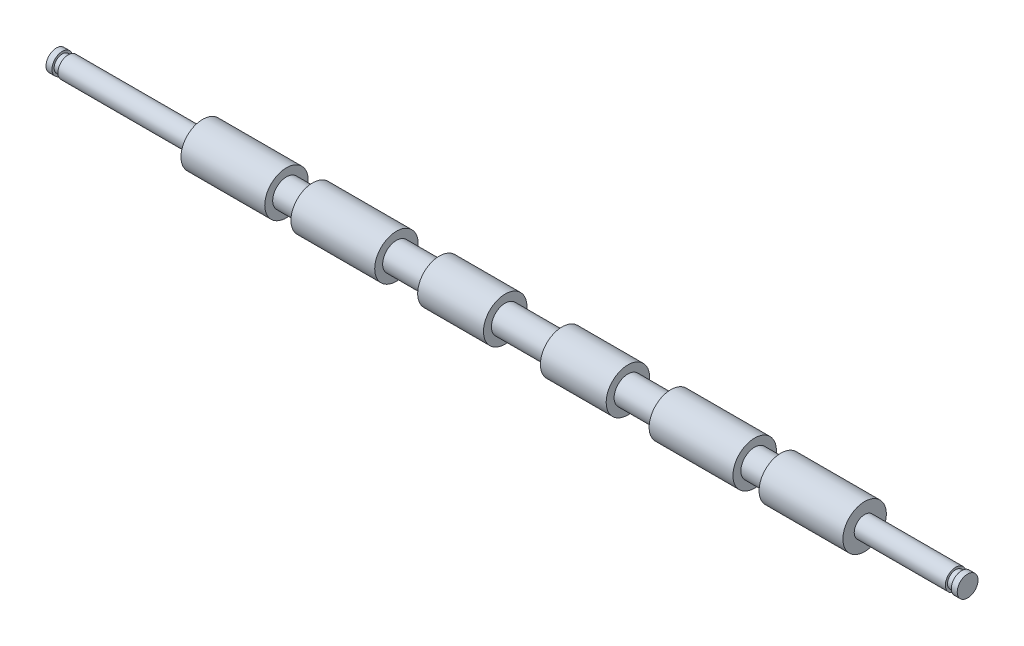
ISO-10303-21;
HEADER;
FILE_DESCRIPTION(('STEP AP214'),'2;1');
FILE_NAME('part.step','',(''),(''),'','','');
FILE_SCHEMA(('AUTOMOTIVE_DESIGN { 1 0 10303 214 1 1 1 1 }'));
ENDSEC;
DATA;
#1=APPLICATION_CONTEXT('core data for automotive mechanical design processes');
#2=APPLICATION_PROTOCOL_DEFINITION('international standard','automotive_design',2000,#1);
#3=PRODUCT_CONTEXT('',#1,'mechanical');
#4=PRODUCT('Part','Part','',(#3));
#5=PRODUCT_RELATED_PRODUCT_CATEGORY('part','',(#4));
#6=PRODUCT_DEFINITION_FORMATION('','',#4);
#7=PRODUCT_DEFINITION_CONTEXT('part definition',#1,'design');
#8=PRODUCT_DEFINITION('design','',#6,#7);
#9=PRODUCT_DEFINITION_SHAPE('','',#8);
#10=(LENGTH_UNIT() NAMED_UNIT(*) SI_UNIT(.MILLI.,.METRE.));
#11=(NAMED_UNIT(*) PLANE_ANGLE_UNIT() SI_UNIT($,.RADIAN.));
#12=(NAMED_UNIT(*) SI_UNIT($,.STERADIAN.) SOLID_ANGLE_UNIT());
#13=UNCERTAINTY_MEASURE_WITH_UNIT(LENGTH_MEASURE(1.E-05),#10,'distance_accuracy_value','');
#14=(GEOMETRIC_REPRESENTATION_CONTEXT(3) GLOBAL_UNCERTAINTY_ASSIGNED_CONTEXT((#13)) GLOBAL_UNIT_ASSIGNED_CONTEXT((#10,
#11,#12)) REPRESENTATION_CONTEXT('',''));
#15=CARTESIAN_POINT('',(0.,0.,0.));
#16=DIRECTION('',(0.,0.,1.));
#17=DIRECTION('',(1.,0.,0.));
#18=AXIS2_PLACEMENT_3D('',#15,#16,#17);
#19=CARTESIAN_POINT('',(0.,0.,0.));
#20=DIRECTION('',(1.,0.,0.));
#21=DIRECTION('',(0.,0.,-1.));
#22=AXIS2_PLACEMENT_3D('',#19,#20,#21);
#23=PLANE('',#22);
#24=CARTESIAN_POINT('',(0.,0.,0.));
#25=DIRECTION('',(-1.,0.,0.));
#26=DIRECTION('',(0.,0.,1.));
#27=AXIS2_PLACEMENT_3D('',#24,#25,#26);
#28=CIRCLE('',#27,2.98);
#29=CARTESIAN_POINT('',(0.,0.,2.98));
#30=VERTEX_POINT('',#29);
#31=EDGE_CURVE('E10',#30,#30,#28,.T.);
#32=ORIENTED_EDGE('',*,*,#31,.T.);
#33=EDGE_LOOP('',(#32));
#34=FACE_BOUND('',#33,.T.);
#35=ADVANCED_FACE('F32',(#34),#23,.F.);
#36=CARTESIAN_POINT('',(0.,0.,0.));
#37=DIRECTION('',(-1.,0.,0.));
#38=DIRECTION('',(0.,0.,1.));
#39=AXIS2_PLACEMENT_3D('',#36,#37,#38);
#40=CYLINDRICAL_SURFACE('',#39,2.98);
#41=ORIENTED_EDGE('',*,*,#31,.F.);
#42=EDGE_LOOP('',(#41));
#43=FACE_BOUND('',#42,.T.);
#44=CARTESIAN_POINT('',(1.7,0.,0.));
#45=DIRECTION('',(-1.,0.,0.));
#46=DIRECTION('',(0.,0.,1.));
#47=AXIS2_PLACEMENT_3D('',#44,#45,#46);
#48=CIRCLE('',#47,2.98);
#49=CARTESIAN_POINT('',(1.7,0.,2.98));
#50=VERTEX_POINT('',#49);
#51=EDGE_CURVE('E38',#50,#50,#48,.T.);
#52=ORIENTED_EDGE('',*,*,#51,.T.);
#53=EDGE_LOOP('',(#52));
#54=FACE_BOUND('',#53,.T.);
#55=ADVANCED_FACE('F154',(#43,#54),#40,.T.);
#56=CARTESIAN_POINT('',(1.7,2.98,0.));
#57=DIRECTION('',(-1.,0.,0.));
#58=DIRECTION('',(0.,0.,1.));
#59=AXIS2_PLACEMENT_3D('',#56,#57,#58);
#60=PLANE('',#59);
#61=ORIENTED_EDGE('',*,*,#51,.F.);
#62=EDGE_LOOP('',(#61));
#63=FACE_BOUND('',#62,.T.);
#64=CARTESIAN_POINT('',(1.7,0.,0.));
#65=DIRECTION('',(-1.,0.,0.));
#66=DIRECTION('',(0.,0.,1.));
#67=AXIS2_PLACEMENT_3D('',#64,#65,#66);
#68=CIRCLE('',#67,2.35);
#69=CARTESIAN_POINT('',(1.7,0.,2.35));
#70=VERTEX_POINT('',#69);
#71=EDGE_CURVE('E42',#70,#70,#68,.T.);
#72=ORIENTED_EDGE('',*,*,#71,.T.);
#73=EDGE_LOOP('',(#72));
#74=FACE_BOUND('',#73,.T.);
#75=ADVANCED_FACE('F158',(#63,#74),#60,.F.);
#76=CARTESIAN_POINT('',(0.,0.,0.));
#77=DIRECTION('',(-1.,0.,0.));
#78=DIRECTION('',(0.,0.,1.));
#79=AXIS2_PLACEMENT_3D('',#76,#77,#78);
#80=CYLINDRICAL_SURFACE('',#79,2.35);
#81=ORIENTED_EDGE('',*,*,#71,.F.);
#82=EDGE_LOOP('',(#81));
#83=FACE_BOUND('',#82,.T.);
#84=CARTESIAN_POINT('',(3.4,0.,0.));
#85=DIRECTION('',(-1.,0.,0.));
#86=DIRECTION('',(0.,0.,1.));
#87=AXIS2_PLACEMENT_3D('',#84,#85,#86);
#88=CIRCLE('',#87,2.35);
#89=CARTESIAN_POINT('',(3.4,0.,2.35));
#90=VERTEX_POINT('',#89);
#91=EDGE_CURVE('E46',#90,#90,#88,.T.);
#92=ORIENTED_EDGE('',*,*,#91,.T.);
#93=EDGE_LOOP('',(#92));
#94=FACE_BOUND('',#93,.T.);
#95=ADVANCED_FACE('F163',(#83,#94),#80,.T.);
#96=CARTESIAN_POINT('',(3.40000000000001,2.35,0.));
#97=DIRECTION('',(1.,0.,0.));
#98=DIRECTION('',(0.,0.,-1.));
#99=AXIS2_PLACEMENT_3D('',#96,#97,#98);
#100=PLANE('',#99);
#101=ORIENTED_EDGE('',*,*,#91,.F.);
#102=EDGE_LOOP('',(#101));
#103=FACE_BOUND('',#102,.T.);
#104=CARTESIAN_POINT('',(3.40000000000001,0.,0.));
#105=DIRECTION('',(-1.,0.,0.));
#106=DIRECTION('',(0.,0.,1.));
#107=AXIS2_PLACEMENT_3D('',#104,#105,#106);
#108=CIRCLE('',#107,2.98);
#109=CARTESIAN_POINT('',(3.40000000000001,0.,2.98));
#110=VERTEX_POINT('',#109);
#111=EDGE_CURVE('E51',#110,#110,#108,.T.);
#112=ORIENTED_EDGE('',*,*,#111,.T.);
#113=EDGE_LOOP('',(#112));
#114=FACE_BOUND('',#113,.T.);
#115=ADVANCED_FACE('F169',(#103,#114),#100,.F.);
#116=CARTESIAN_POINT('',(0.,0.,0.));
#117=DIRECTION('',(-1.,0.,0.));
#118=DIRECTION('',(0.,0.,1.));
#119=AXIS2_PLACEMENT_3D('',#116,#117,#118);
#120=CYLINDRICAL_SURFACE('',#119,2.98);
#121=ORIENTED_EDGE('',*,*,#111,.F.);
#122=EDGE_LOOP('',(#121));
#123=FACE_BOUND('',#122,.T.);
#124=CARTESIAN_POINT('',(41.9,0.,0.));
#125=DIRECTION('',(-1.,0.,0.));
#126=DIRECTION('',(0.,0.,1.));
#127=AXIS2_PLACEMENT_3D('',#124,#125,#126);
#128=CIRCLE('',#127,2.97999999999999);
#129=CARTESIAN_POINT('',(41.9,0.,2.97999999999999));
#130=VERTEX_POINT('',#129);
#131=EDGE_CURVE('E54',#130,#130,#128,.T.);
#132=ORIENTED_EDGE('',*,*,#131,.T.);
#133=EDGE_LOOP('',(#132));
#134=FACE_BOUND('',#133,.T.);
#135=ADVANCED_FACE('F173',(#123,#134),#120,.T.);
#136=CARTESIAN_POINT('',(41.9,2.97999999999999,0.));
#137=DIRECTION('',(1.,0.,0.));
#138=DIRECTION('',(0.,0.,-1.));
#139=AXIS2_PLACEMENT_3D('',#136,#137,#138);
#140=PLANE('',#139);
#141=ORIENTED_EDGE('',*,*,#131,.F.);
#142=EDGE_LOOP('',(#141));
#143=FACE_BOUND('',#142,.T.);
#144=CARTESIAN_POINT('',(41.9,0.,0.));
#145=DIRECTION('',(-1.,0.,0.));
#146=DIRECTION('',(0.,0.,1.));
#147=AXIS2_PLACEMENT_3D('',#144,#145,#146);
#148=CIRCLE('',#147,6.225);
#149=CARTESIAN_POINT('',(41.9,0.,6.225));
#150=VERTEX_POINT('',#149);
#151=EDGE_CURVE('E57',#150,#150,#148,.T.);
#152=ORIENTED_EDGE('',*,*,#151,.T.);
#153=EDGE_LOOP('',(#152));
#154=FACE_BOUND('',#153,.T.);
#155=ADVANCED_FACE('F177',(#143,#154),#140,.F.);
#156=CARTESIAN_POINT('',(0.,0.,0.));
#157=DIRECTION('',(-1.,0.,0.));
#158=DIRECTION('',(0.,0.,1.));
#159=AXIS2_PLACEMENT_3D('',#156,#157,#158);
#160=CYLINDRICAL_SURFACE('',#159,6.225);
#161=ORIENTED_EDGE('',*,*,#151,.F.);
#162=EDGE_LOOP('',(#161));
#163=FACE_BOUND('',#162,.T.);
#164=CARTESIAN_POINT('',(65.9,0.,0.));
#165=DIRECTION('',(-1.,0.,0.));
#166=DIRECTION('',(0.,0.,1.));
#167=AXIS2_PLACEMENT_3D('',#164,#165,#166);
#168=CIRCLE('',#167,6.225);
#169=CARTESIAN_POINT('',(65.9,0.,6.225));
#170=VERTEX_POINT('',#169);
#171=EDGE_CURVE('E60',#170,#170,#168,.T.);
#172=ORIENTED_EDGE('',*,*,#171,.T.);
#173=EDGE_LOOP('',(#172));
#174=FACE_BOUND('',#173,.T.);
#175=ADVANCED_FACE('F181',(#163,#174),#160,.T.);
#176=CARTESIAN_POINT('',(65.9,6.225,0.));
#177=DIRECTION('',(-1.,0.,0.));
#178=DIRECTION('',(0.,0.,1.));
#179=AXIS2_PLACEMENT_3D('',#176,#177,#178);
#180=PLANE('',#179);
#181=ORIENTED_EDGE('',*,*,#171,.F.);
#182=EDGE_LOOP('',(#181));
#183=FACE_BOUND('',#182,.T.);
#184=CARTESIAN_POINT('',(65.9,0.,0.));
#185=DIRECTION('',(-1.,0.,0.));
#186=DIRECTION('',(0.,0.,1.));
#187=AXIS2_PLACEMENT_3D('',#184,#185,#186);
#188=CIRCLE('',#187,3.95);
#189=CARTESIAN_POINT('',(65.9,0.,3.95));
#190=VERTEX_POINT('',#189);
#191=EDGE_CURVE('E63',#190,#190,#188,.T.);
#192=ORIENTED_EDGE('',*,*,#191,.T.);
#193=EDGE_LOOP('',(#192));
#194=FACE_BOUND('',#193,.T.);
#195=ADVANCED_FACE('F185',(#183,#194),#180,.F.);
#196=CARTESIAN_POINT('',(0.,0.,0.));
#197=DIRECTION('',(-1.,0.,0.));
#198=DIRECTION('',(0.,0.,1.));
#199=AXIS2_PLACEMENT_3D('',#196,#197,#198);
#200=CYLINDRICAL_SURFACE('',#199,3.95);
#201=ORIENTED_EDGE('',*,*,#191,.F.);
#202=EDGE_LOOP('',(#201));
#203=FACE_BOUND('',#202,.T.);
#204=CARTESIAN_POINT('',(73.4,0.,0.));
#205=DIRECTION('',(-1.,0.,0.));
#206=DIRECTION('',(0.,0.,1.));
#207=AXIS2_PLACEMENT_3D('',#204,#205,#206);
#208=CIRCLE('',#207,3.95);
#209=CARTESIAN_POINT('',(73.4,0.,3.95));
#210=VERTEX_POINT('',#209);
#211=EDGE_CURVE('E66',#210,#210,#208,.T.);
#212=ORIENTED_EDGE('',*,*,#211,.T.);
#213=EDGE_LOOP('',(#212));
#214=FACE_BOUND('',#213,.T.);
#215=ADVANCED_FACE('F189',(#203,#214),#200,.T.);
#216=CARTESIAN_POINT('',(73.4,3.95,0.));
#217=DIRECTION('',(1.,0.,0.));
#218=DIRECTION('',(0.,0.,-1.));
#219=AXIS2_PLACEMENT_3D('',#216,#217,#218);
#220=PLANE('',#219);
#221=ORIENTED_EDGE('',*,*,#211,.F.);
#222=EDGE_LOOP('',(#221));
#223=FACE_BOUND('',#222,.T.);
#224=CARTESIAN_POINT('',(73.4,0.,0.));
#225=DIRECTION('',(-1.,0.,0.));
#226=DIRECTION('',(0.,0.,1.));
#227=AXIS2_PLACEMENT_3D('',#224,#225,#226);
#228=CIRCLE('',#227,6.225);
#229=CARTESIAN_POINT('',(73.4,0.,6.225));
#230=VERTEX_POINT('',#229);
#231=EDGE_CURVE('E69',#230,#230,#228,.T.);
#232=ORIENTED_EDGE('',*,*,#231,.T.);
#233=EDGE_LOOP('',(#232));
#234=FACE_BOUND('',#233,.T.);
#235=ADVANCED_FACE('F193',(#223,#234),#220,.F.);
#236=CARTESIAN_POINT('',(0.,0.,0.));
#237=DIRECTION('',(-1.,0.,0.));
#238=DIRECTION('',(0.,0.,1.));
#239=AXIS2_PLACEMENT_3D('',#236,#237,#238);
#240=CYLINDRICAL_SURFACE('',#239,6.225);
#241=ORIENTED_EDGE('',*,*,#231,.F.);
#242=EDGE_LOOP('',(#241));
#243=FACE_BOUND('',#242,.T.);
#244=CARTESIAN_POINT('',(97.4,0.,0.));
#245=DIRECTION('',(-1.,0.,0.));
#246=DIRECTION('',(0.,0.,1.));
#247=AXIS2_PLACEMENT_3D('',#244,#245,#246);
#248=CIRCLE('',#247,6.225);
#249=CARTESIAN_POINT('',(97.4,0.,6.225));
#250=VERTEX_POINT('',#249);
#251=EDGE_CURVE('E72',#250,#250,#248,.T.);
#252=ORIENTED_EDGE('',*,*,#251,.T.);
#253=EDGE_LOOP('',(#252));
#254=FACE_BOUND('',#253,.T.);
#255=ADVANCED_FACE('F197',(#243,#254),#240,.T.);
#256=CARTESIAN_POINT('',(97.4,6.225,0.));
#257=DIRECTION('',(-1.,0.,0.));
#258=DIRECTION('',(0.,0.,1.));
#259=AXIS2_PLACEMENT_3D('',#256,#257,#258);
#260=PLANE('',#259);
#261=ORIENTED_EDGE('',*,*,#251,.F.);
#262=EDGE_LOOP('',(#261));
#263=FACE_BOUND('',#262,.T.);
#264=CARTESIAN_POINT('',(97.4,0.,0.));
#265=DIRECTION('',(-1.,0.,0.));
#266=DIRECTION('',(0.,0.,1.));
#267=AXIS2_PLACEMENT_3D('',#264,#265,#266);
#268=CIRCLE('',#267,3.95);
#269=CARTESIAN_POINT('',(97.4,0.,3.95));
#270=VERTEX_POINT('',#269);
#271=EDGE_CURVE('E75',#270,#270,#268,.T.);
#272=ORIENTED_EDGE('',*,*,#271,.T.);
#273=EDGE_LOOP('',(#272));
#274=FACE_BOUND('',#273,.T.);
#275=ADVANCED_FACE('F201',(#263,#274),#260,.F.);
#276=CARTESIAN_POINT('',(0.,0.,0.));
#277=DIRECTION('',(-1.,0.,0.));
#278=DIRECTION('',(0.,0.,1.));
#279=AXIS2_PLACEMENT_3D('',#276,#277,#278);
#280=CYLINDRICAL_SURFACE('',#279,3.95);
#281=ORIENTED_EDGE('',*,*,#271,.F.);
#282=EDGE_LOOP('',(#281));
#283=FACE_BOUND('',#282,.T.);
#284=CARTESIAN_POINT('',(109.7,0.,0.));
#285=DIRECTION('',(-1.,0.,0.));
#286=DIRECTION('',(0.,0.,1.));
#287=AXIS2_PLACEMENT_3D('',#284,#285,#286);
#288=CIRCLE('',#287,3.95);
#289=CARTESIAN_POINT('',(109.7,0.,3.95));
#290=VERTEX_POINT('',#289);
#291=EDGE_CURVE('E78',#290,#290,#288,.T.);
#292=ORIENTED_EDGE('',*,*,#291,.T.);
#293=EDGE_LOOP('',(#292));
#294=FACE_BOUND('',#293,.T.);
#295=ADVANCED_FACE('F205',(#283,#294),#280,.T.);
#296=CARTESIAN_POINT('',(109.7,3.95,0.));
#297=DIRECTION('',(1.,0.,0.));
#298=DIRECTION('',(0.,0.,-1.));
#299=AXIS2_PLACEMENT_3D('',#296,#297,#298);
#300=PLANE('',#299);
#301=ORIENTED_EDGE('',*,*,#291,.F.);
#302=EDGE_LOOP('',(#301));
#303=FACE_BOUND('',#302,.T.);
#304=CARTESIAN_POINT('',(109.7,0.,0.));
#305=DIRECTION('',(-1.,0.,0.));
#306=DIRECTION('',(0.,0.,1.));
#307=AXIS2_PLACEMENT_3D('',#304,#305,#306);
#308=CIRCLE('',#307,6.225);
#309=CARTESIAN_POINT('',(109.7,0.,6.225));
#310=VERTEX_POINT('',#309);
#311=EDGE_CURVE('E81',#310,#310,#308,.T.);
#312=ORIENTED_EDGE('',*,*,#311,.T.);
#313=EDGE_LOOP('',(#312));
#314=FACE_BOUND('',#313,.T.);
#315=ADVANCED_FACE('F209',(#303,#314),#300,.F.);
#316=CARTESIAN_POINT('',(0.,0.,0.));
#317=DIRECTION('',(-1.,0.,0.));
#318=DIRECTION('',(0.,0.,1.));
#319=AXIS2_PLACEMENT_3D('',#316,#317,#318);
#320=CYLINDRICAL_SURFACE('',#319,6.225);
#321=ORIENTED_EDGE('',*,*,#311,.F.);
#322=EDGE_LOOP('',(#321));
#323=FACE_BOUND('',#322,.T.);
#324=CARTESIAN_POINT('',(128.55,0.,0.));
#325=DIRECTION('',(-1.,0.,0.));
#326=DIRECTION('',(0.,0.,1.));
#327=AXIS2_PLACEMENT_3D('',#324,#325,#326);
#328=CIRCLE('',#327,6.225);
#329=CARTESIAN_POINT('',(128.55,0.,6.225));
#330=VERTEX_POINT('',#329);
#331=EDGE_CURVE('E84',#330,#330,#328,.T.);
#332=ORIENTED_EDGE('',*,*,#331,.T.);
#333=EDGE_LOOP('',(#332));
#334=FACE_BOUND('',#333,.T.);
#335=ADVANCED_FACE('F213',(#323,#334),#320,.T.);
#336=CARTESIAN_POINT('',(128.55,6.225,0.));
#337=DIRECTION('',(-1.,0.,0.));
#338=DIRECTION('',(0.,0.,1.));
#339=AXIS2_PLACEMENT_3D('',#336,#337,#338);
#340=PLANE('',#339);
#341=ORIENTED_EDGE('',*,*,#331,.F.);
#342=EDGE_LOOP('',(#341));
#343=FACE_BOUND('',#342,.T.);
#344=CARTESIAN_POINT('',(128.55,0.,0.));
#345=DIRECTION('',(-1.,0.,0.));
#346=DIRECTION('',(0.,0.,1.));
#347=AXIS2_PLACEMENT_3D('',#344,#345,#346);
#348=CIRCLE('',#347,3.95);
#349=CARTESIAN_POINT('',(128.55,0.,3.95));
#350=VERTEX_POINT('',#349);
#351=EDGE_CURVE('E87',#350,#350,#348,.T.);
#352=ORIENTED_EDGE('',*,*,#351,.T.);
#353=EDGE_LOOP('',(#352));
#354=FACE_BOUND('',#353,.T.);
#355=ADVANCED_FACE('F217',(#343,#354),#340,.F.);
#356=CARTESIAN_POINT('',(0.,0.,0.));
#357=DIRECTION('',(-1.,0.,0.));
#358=DIRECTION('',(0.,0.,1.));
#359=AXIS2_PLACEMENT_3D('',#356,#357,#358);
#360=CYLINDRICAL_SURFACE('',#359,3.95000000000006);
#361=ORIENTED_EDGE('',*,*,#351,.F.);
#362=EDGE_LOOP('',(#361));
#363=FACE_BOUND('',#362,.T.);
#364=CARTESIAN_POINT('',(144.85,0.,0.));
#365=DIRECTION('',(-1.,0.,0.));
#366=DIRECTION('',(0.,0.,1.));
#367=AXIS2_PLACEMENT_3D('',#364,#365,#366);
#368=CIRCLE('',#367,3.95000000000011);
#369=CARTESIAN_POINT('',(144.85,0.,3.95000000000011));
#370=VERTEX_POINT('',#369);
#371=EDGE_CURVE('E90',#370,#370,#368,.T.);
#372=ORIENTED_EDGE('',*,*,#371,.T.);
#373=EDGE_LOOP('',(#372));
#374=FACE_BOUND('',#373,.T.);
#375=ADVANCED_FACE('F221',(#363,#374),#360,.T.);
#376=CARTESIAN_POINT('',(144.85,6.22500000000011,0.));
#377=DIRECTION('',(1.,0.,0.));
#378=DIRECTION('',(0.,0.,-1.));
#379=AXIS2_PLACEMENT_3D('',#376,#377,#378);
#380=PLANE('',#379);
#381=ORIENTED_EDGE('',*,*,#371,.F.);
#382=EDGE_LOOP('',(#381));
#383=FACE_BOUND('',#382,.T.);
#384=CARTESIAN_POINT('',(144.85,0.,0.));
#385=DIRECTION('',(-1.,0.,0.));
#386=DIRECTION('',(0.,0.,1.));
#387=AXIS2_PLACEMENT_3D('',#384,#385,#386);
#388=CIRCLE('',#387,6.22500000000011);
#389=CARTESIAN_POINT('',(144.85,0.,6.22500000000011));
#390=VERTEX_POINT('',#389);
#391=EDGE_CURVE('E93',#390,#390,#388,.T.);
#392=ORIENTED_EDGE('',*,*,#391,.T.);
#393=EDGE_LOOP('',(#392));
#394=FACE_BOUND('',#393,.T.);
#395=ADVANCED_FACE('F225',(#383,#394),#380,.F.);
#396=CARTESIAN_POINT('',(0.,0.,0.));
#397=DIRECTION('',(-1.,0.,0.));
#398=DIRECTION('',(0.,0.,1.));
#399=AXIS2_PLACEMENT_3D('',#396,#397,#398);
#400=CYLINDRICAL_SURFACE('',#399,6.22500000000025);
#401=ORIENTED_EDGE('',*,*,#391,.F.);
#402=EDGE_LOOP('',(#401));
#403=FACE_BOUND('',#402,.T.);
#404=CARTESIAN_POINT('',(163.7,0.,0.));
#405=DIRECTION('',(-1.,0.,0.));
#406=DIRECTION('',(0.,0.,1.));
#407=AXIS2_PLACEMENT_3D('',#404,#405,#406);
#408=CIRCLE('',#407,6.22500000000038);
#409=CARTESIAN_POINT('',(163.7,0.,6.22500000000038));
#410=VERTEX_POINT('',#409);
#411=EDGE_CURVE('E96',#410,#410,#408,.T.);
#412=ORIENTED_EDGE('',*,*,#411,.T.);
#413=EDGE_LOOP('',(#412));
#414=FACE_BOUND('',#413,.T.);
#415=ADVANCED_FACE('F229',(#403,#414),#400,.T.);
#416=CARTESIAN_POINT('',(163.7,3.95000000000038,0.));
#417=DIRECTION('',(-1.,0.,0.));
#418=DIRECTION('',(0.,0.,1.));
#419=AXIS2_PLACEMENT_3D('',#416,#417,#418);
#420=PLANE('',#419);
#421=ORIENTED_EDGE('',*,*,#411,.F.);
#422=EDGE_LOOP('',(#421));
#423=FACE_BOUND('',#422,.T.);
#424=CARTESIAN_POINT('',(163.7,0.,0.));
#425=DIRECTION('',(-1.,0.,0.));
#426=DIRECTION('',(0.,0.,1.));
#427=AXIS2_PLACEMENT_3D('',#424,#425,#426);
#428=CIRCLE('',#427,3.95000000000038);
#429=CARTESIAN_POINT('',(163.7,0.,3.95000000000038));
#430=VERTEX_POINT('',#429);
#431=EDGE_CURVE('E99',#430,#430,#428,.T.);
#432=ORIENTED_EDGE('',*,*,#431,.T.);
#433=EDGE_LOOP('',(#432));
#434=FACE_BOUND('',#433,.T.);
#435=ADVANCED_FACE('F233',(#423,#434),#420,.F.);
#436=CARTESIAN_POINT('',(0.,0.,0.));
#437=DIRECTION('',(-1.,0.,0.));
#438=DIRECTION('',(0.,0.,1.));
#439=AXIS2_PLACEMENT_3D('',#436,#437,#438);
#440=CYLINDRICAL_SURFACE('',#439,3.95000000000047);
#441=ORIENTED_EDGE('',*,*,#431,.F.);
#442=EDGE_LOOP('',(#441));
#443=FACE_BOUND('',#442,.T.);
#444=CARTESIAN_POINT('',(176.,0.,0.));
#445=DIRECTION('',(-1.,0.,0.));
#446=DIRECTION('',(0.,0.,1.));
#447=AXIS2_PLACEMENT_3D('',#444,#445,#446);
#448=CIRCLE('',#447,3.95000000000055);
#449=CARTESIAN_POINT('',(176.,0.,3.95000000000055));
#450=VERTEX_POINT('',#449);
#451=EDGE_CURVE('E102',#450,#450,#448,.T.);
#452=ORIENTED_EDGE('',*,*,#451,.T.);
#453=EDGE_LOOP('',(#452));
#454=FACE_BOUND('',#453,.T.);
#455=ADVANCED_FACE('F237',(#443,#454),#440,.T.);
#456=CARTESIAN_POINT('',(176.,6.22500000000055,0.));
#457=DIRECTION('',(1.,0.,0.));
#458=DIRECTION('',(0.,0.,-1.));
#459=AXIS2_PLACEMENT_3D('',#456,#457,#458);
#460=PLANE('',#459);
#461=ORIENTED_EDGE('',*,*,#451,.F.);
#462=EDGE_LOOP('',(#461));
#463=FACE_BOUND('',#462,.T.);
#464=CARTESIAN_POINT('',(176.,0.,0.));
#465=DIRECTION('',(-1.,0.,0.));
#466=DIRECTION('',(0.,0.,1.));
#467=AXIS2_PLACEMENT_3D('',#464,#465,#466);
#468=CIRCLE('',#467,6.22500000000055);
#469=CARTESIAN_POINT('',(176.,0.,6.22500000000055));
#470=VERTEX_POINT('',#469);
#471=EDGE_CURVE('E105',#470,#470,#468,.T.);
#472=ORIENTED_EDGE('',*,*,#471,.T.);
#473=EDGE_LOOP('',(#472));
#474=FACE_BOUND('',#473,.T.);
#475=ADVANCED_FACE('F241',(#463,#474),#460,.F.);
#476=CARTESIAN_POINT('',(0.,0.,0.));
#477=DIRECTION('',(-1.,0.,0.));
#478=DIRECTION('',(0.,0.,1.));
#479=AXIS2_PLACEMENT_3D('',#476,#477,#478);
#480=CYLINDRICAL_SURFACE('',#479,6.22500000000072);
#481=ORIENTED_EDGE('',*,*,#471,.F.);
#482=EDGE_LOOP('',(#481));
#483=FACE_BOUND('',#482,.T.);
#484=CARTESIAN_POINT('',(200.,0.,0.));
#485=DIRECTION('',(-1.,0.,0.));
#486=DIRECTION('',(0.,0.,1.));
#487=AXIS2_PLACEMENT_3D('',#484,#485,#486);
#488=CIRCLE('',#487,6.22500000000089);
#489=CARTESIAN_POINT('',(200.,0.,6.22500000000089));
#490=VERTEX_POINT('',#489);
#491=EDGE_CURVE('E108',#490,#490,#488,.T.);
#492=ORIENTED_EDGE('',*,*,#491,.T.);
#493=EDGE_LOOP('',(#492));
#494=FACE_BOUND('',#493,.T.);
#495=ADVANCED_FACE('F245',(#483,#494),#480,.T.);
#496=CARTESIAN_POINT('',(200.,3.95000000000089,0.));
#497=DIRECTION('',(-1.,0.,0.));
#498=DIRECTION('',(0.,0.,1.));
#499=AXIS2_PLACEMENT_3D('',#496,#497,#498);
#500=PLANE('',#499);
#501=ORIENTED_EDGE('',*,*,#491,.F.);
#502=EDGE_LOOP('',(#501));
#503=FACE_BOUND('',#502,.T.);
#504=CARTESIAN_POINT('',(200.,0.,0.));
#505=DIRECTION('',(-1.,0.,0.));
#506=DIRECTION('',(0.,0.,1.));
#507=AXIS2_PLACEMENT_3D('',#504,#505,#506);
#508=CIRCLE('',#507,3.95000000000089);
#509=CARTESIAN_POINT('',(200.,0.,3.95000000000089));
#510=VERTEX_POINT('',#509);
#511=EDGE_CURVE('E111',#510,#510,#508,.T.);
#512=ORIENTED_EDGE('',*,*,#511,.T.);
#513=EDGE_LOOP('',(#512));
#514=FACE_BOUND('',#513,.T.);
#515=ADVANCED_FACE('F249',(#503,#514),#500,.F.);
#516=CARTESIAN_POINT('',(0.,0.,0.));
#517=DIRECTION('',(-1.,0.,0.));
#518=DIRECTION('',(0.,0.,1.));
#519=AXIS2_PLACEMENT_3D('',#516,#517,#518);
#520=CYLINDRICAL_SURFACE('',#519,3.95000000000094);
#521=ORIENTED_EDGE('',*,*,#511,.F.);
#522=EDGE_LOOP('',(#521));
#523=FACE_BOUND('',#522,.T.);
#524=CARTESIAN_POINT('',(207.5,0.,0.));
#525=DIRECTION('',(-1.,0.,0.));
#526=DIRECTION('',(0.,0.,1.));
#527=AXIS2_PLACEMENT_3D('',#524,#525,#526);
#528=CIRCLE('',#527,3.950000000001);
#529=CARTESIAN_POINT('',(207.5,0.,3.950000000001));
#530=VERTEX_POINT('',#529);
#531=EDGE_CURVE('E114',#530,#530,#528,.T.);
#532=ORIENTED_EDGE('',*,*,#531,.T.);
#533=EDGE_LOOP('',(#532));
#534=FACE_BOUND('',#533,.T.);
#535=ADVANCED_FACE('F253',(#523,#534),#520,.T.);
#536=CARTESIAN_POINT('',(207.5,6.225000000001,0.));
#537=DIRECTION('',(1.,0.,0.));
#538=DIRECTION('',(0.,0.,-1.));
#539=AXIS2_PLACEMENT_3D('',#536,#537,#538);
#540=PLANE('',#539);
#541=ORIENTED_EDGE('',*,*,#531,.F.);
#542=EDGE_LOOP('',(#541));
#543=FACE_BOUND('',#542,.T.);
#544=CARTESIAN_POINT('',(207.5,0.,0.));
#545=DIRECTION('',(-1.,0.,0.));
#546=DIRECTION('',(0.,0.,1.));
#547=AXIS2_PLACEMENT_3D('',#544,#545,#546);
#548=CIRCLE('',#547,6.225000000001);
#549=CARTESIAN_POINT('',(207.5,0.,6.225000000001));
#550=VERTEX_POINT('',#549);
#551=EDGE_CURVE('E117',#550,#550,#548,.T.);
#552=ORIENTED_EDGE('',*,*,#551,.T.);
#553=EDGE_LOOP('',(#552));
#554=FACE_BOUND('',#553,.T.);
#555=ADVANCED_FACE('F257',(#543,#554),#540,.F.);
#556=CARTESIAN_POINT('',(0.,0.,0.));
#557=DIRECTION('',(-1.,0.,0.));
#558=DIRECTION('',(0.,0.,1.));
#559=AXIS2_PLACEMENT_3D('',#556,#557,#558);
#560=CYLINDRICAL_SURFACE('',#559,6.22500000000116);
#561=ORIENTED_EDGE('',*,*,#551,.F.);
#562=EDGE_LOOP('',(#561));
#563=FACE_BOUND('',#562,.T.);
#564=CARTESIAN_POINT('',(231.5,0.,0.));
#565=DIRECTION('',(-1.,0.,0.));
#566=DIRECTION('',(0.,0.,1.));
#567=AXIS2_PLACEMENT_3D('',#564,#565,#566);
#568=CIRCLE('',#567,6.22500000000133);
#569=CARTESIAN_POINT('',(231.5,0.,6.22500000000133));
#570=VERTEX_POINT('',#569);
#571=EDGE_CURVE('E120',#570,#570,#568,.T.);
#572=ORIENTED_EDGE('',*,*,#571,.T.);
#573=EDGE_LOOP('',(#572));
#574=FACE_BOUND('',#573,.T.);
#575=ADVANCED_FACE('F261',(#563,#574),#560,.T.);
#576=CARTESIAN_POINT('',(231.5,2.98000000000132,0.));
#577=DIRECTION('',(-1.,0.,0.));
#578=DIRECTION('',(0.,0.,1.));
#579=AXIS2_PLACEMENT_3D('',#576,#577,#578);
#580=PLANE('',#579);
#581=ORIENTED_EDGE('',*,*,#571,.F.);
#582=EDGE_LOOP('',(#581));
#583=FACE_BOUND('',#582,.T.);
#584=CARTESIAN_POINT('',(231.5,0.,0.));
#585=DIRECTION('',(-1.,0.,0.));
#586=DIRECTION('',(0.,0.,1.));
#587=AXIS2_PLACEMENT_3D('',#584,#585,#586);
#588=CIRCLE('',#587,2.98000000000132);
#589=CARTESIAN_POINT('',(231.5,0.,2.98000000000132));
#590=VERTEX_POINT('',#589);
#591=EDGE_CURVE('E123',#590,#590,#588,.T.);
#592=ORIENTED_EDGE('',*,*,#591,.T.);
#593=EDGE_LOOP('',(#592));
#594=FACE_BOUND('',#593,.T.);
#595=ADVANCED_FACE('F265',(#583,#594),#580,.F.);
#596=CARTESIAN_POINT('',(0.,0.,0.));
#597=DIRECTION('',(-1.,0.,0.));
#598=DIRECTION('',(0.,0.,1.));
#599=AXIS2_PLACEMENT_3D('',#596,#597,#598);
#600=CYLINDRICAL_SURFACE('',#599,2.98000000000066);
#601=ORIENTED_EDGE('',*,*,#591,.F.);
#602=EDGE_LOOP('',(#601));
#603=FACE_BOUND('',#602,.T.);
#604=CARTESIAN_POINT('',(257.6,0.,0.));
#605=DIRECTION('',(-1.,0.,0.));
#606=DIRECTION('',(0.,0.,1.));
#607=AXIS2_PLACEMENT_3D('',#604,#605,#606);
#608=CIRCLE('',#607,2.98);
#609=CARTESIAN_POINT('',(257.6,0.,2.98));
#610=VERTEX_POINT('',#609);
#611=EDGE_CURVE('E126',#610,#610,#608,.T.);
#612=ORIENTED_EDGE('',*,*,#611,.T.);
#613=EDGE_LOOP('',(#612));
#614=FACE_BOUND('',#613,.T.);
#615=ADVANCED_FACE('F269',(#603,#614),#600,.T.);
#616=CARTESIAN_POINT('',(257.6,2.98,0.));
#617=DIRECTION('',(-1.,0.,0.));
#618=DIRECTION('',(0.,0.,1.));
#619=AXIS2_PLACEMENT_3D('',#616,#617,#618);
#620=PLANE('',#619);
#621=ORIENTED_EDGE('',*,*,#611,.F.);
#622=EDGE_LOOP('',(#621));
#623=FACE_BOUND('',#622,.T.);
#624=CARTESIAN_POINT('',(257.6,0.,0.));
#625=DIRECTION('',(-1.,0.,0.));
#626=DIRECTION('',(0.,0.,1.));
#627=AXIS2_PLACEMENT_3D('',#624,#625,#626);
#628=CIRCLE('',#627,2.34999999999735);
#629=CARTESIAN_POINT('',(257.6,0.,2.34999999999735));
#630=VERTEX_POINT('',#629);
#631=EDGE_CURVE('E129',#630,#630,#628,.T.);
#632=ORIENTED_EDGE('',*,*,#631,.T.);
#633=EDGE_LOOP('',(#632));
#634=FACE_BOUND('',#633,.T.);
#635=ADVANCED_FACE('F273',(#623,#634),#620,.F.);
#636=CARTESIAN_POINT('',(0.,0.,0.));
#637=DIRECTION('',(-1.,0.,0.));
#638=DIRECTION('',(0.,0.,1.));
#639=AXIS2_PLACEMENT_3D('',#636,#637,#638);
#640=CYLINDRICAL_SURFACE('',#639,2.34999999999735);
#641=ORIENTED_EDGE('',*,*,#631,.F.);
#642=EDGE_LOOP('',(#641));
#643=FACE_BOUND('',#642,.T.);
#644=CARTESIAN_POINT('',(259.3,0.,0.));
#645=DIRECTION('',(-1.,0.,0.));
#646=DIRECTION('',(0.,0.,1.));
#647=AXIS2_PLACEMENT_3D('',#644,#645,#646);
#648=CIRCLE('',#647,2.34999999999735);
#649=CARTESIAN_POINT('',(259.3,0.,2.34999999999735));
#650=VERTEX_POINT('',#649);
#651=EDGE_CURVE('E132',#650,#650,#648,.T.);
#652=ORIENTED_EDGE('',*,*,#651,.T.);
#653=EDGE_LOOP('',(#652));
#654=FACE_BOUND('',#653,.T.);
#655=ADVANCED_FACE('F277',(#643,#654),#640,.T.);
#656=CARTESIAN_POINT('',(259.3,2.34999999999735,0.));
#657=DIRECTION('',(1.,0.,0.));
#658=DIRECTION('',(0.,0.,-1.));
#659=AXIS2_PLACEMENT_3D('',#656,#657,#658);
#660=PLANE('',#659);
#661=ORIENTED_EDGE('',*,*,#651,.F.);
#662=EDGE_LOOP('',(#661));
#663=FACE_BOUND('',#662,.T.);
#664=CARTESIAN_POINT('',(259.3,0.,0.));
#665=DIRECTION('',(-1.,0.,0.));
#666=DIRECTION('',(0.,0.,1.));
#667=AXIS2_PLACEMENT_3D('',#664,#665,#666);
#668=CIRCLE('',#667,2.97999999999998);
#669=CARTESIAN_POINT('',(259.3,0.,2.97999999999998));
#670=VERTEX_POINT('',#669);
#671=EDGE_CURVE('E135',#670,#670,#668,.T.);
#672=ORIENTED_EDGE('',*,*,#671,.T.);
#673=EDGE_LOOP('',(#672));
#674=FACE_BOUND('',#673,.T.);
#675=ADVANCED_FACE('F150',(#663,#674),#660,.F.);
#676=CARTESIAN_POINT('',(0.,0.,0.));
#677=DIRECTION('',(-1.,0.,0.));
#678=DIRECTION('',(0.,0.,1.));
#679=AXIS2_PLACEMENT_3D('',#676,#677,#678);
#680=CYLINDRICAL_SURFACE('',#679,2.97999999999998);
#681=ORIENTED_EDGE('',*,*,#671,.F.);
#682=EDGE_LOOP('',(#681));
#683=FACE_BOUND('',#682,.T.);
#684=CARTESIAN_POINT('',(261.,0.,0.));
#685=DIRECTION('',(-1.,0.,0.));
#686=DIRECTION('',(0.,0.,1.));
#687=AXIS2_PLACEMENT_3D('',#684,#685,#686);
#688=CIRCLE('',#687,2.97999999999998);
#689=CARTESIAN_POINT('',(261.,0.,2.97999999999998));
#690=VERTEX_POINT('',#689);
#691=EDGE_CURVE('E138',#690,#690,#688,.T.);
#692=ORIENTED_EDGE('',*,*,#691,.T.);
#693=EDGE_LOOP('',(#692));
#694=FACE_BOUND('',#693,.T.);
#695=ADVANCED_FACE('F142',(#683,#694),#680,.T.);
#696=CARTESIAN_POINT('',(261.,2.97999999999998,0.));
#697=DIRECTION('',(-1.,0.,0.));
#698=DIRECTION('',(0.,0.,1.));
#699=AXIS2_PLACEMENT_3D('',#696,#697,#698);
#700=PLANE('',#699);
#701=ORIENTED_EDGE('',*,*,#691,.F.);
#702=EDGE_LOOP('',(#701));
#703=FACE_BOUND('',#702,.T.);
#704=ADVANCED_FACE('F144',(#703),#700,.F.);
#705=CLOSED_SHELL('',(#35,#55,#75,#95,#115,#135,#155,#175,#195,#215,#235,#255,#275,#295,#315,
#335,#355,#375,#395,#415,#435,#455,#475,#495,#515,#535,#555,#575,#595,#615,#635,#655,#675,#695,#704));
#706=MANIFOLD_SOLID_BREP('B2',#705);
#707=ADVANCED_BREP_SHAPE_REPRESENTATION('',(#18,#706),#14);
#708=SHAPE_DEFINITION_REPRESENTATION(#9,#707);
ENDSEC;
END-ISO-10303-21;
